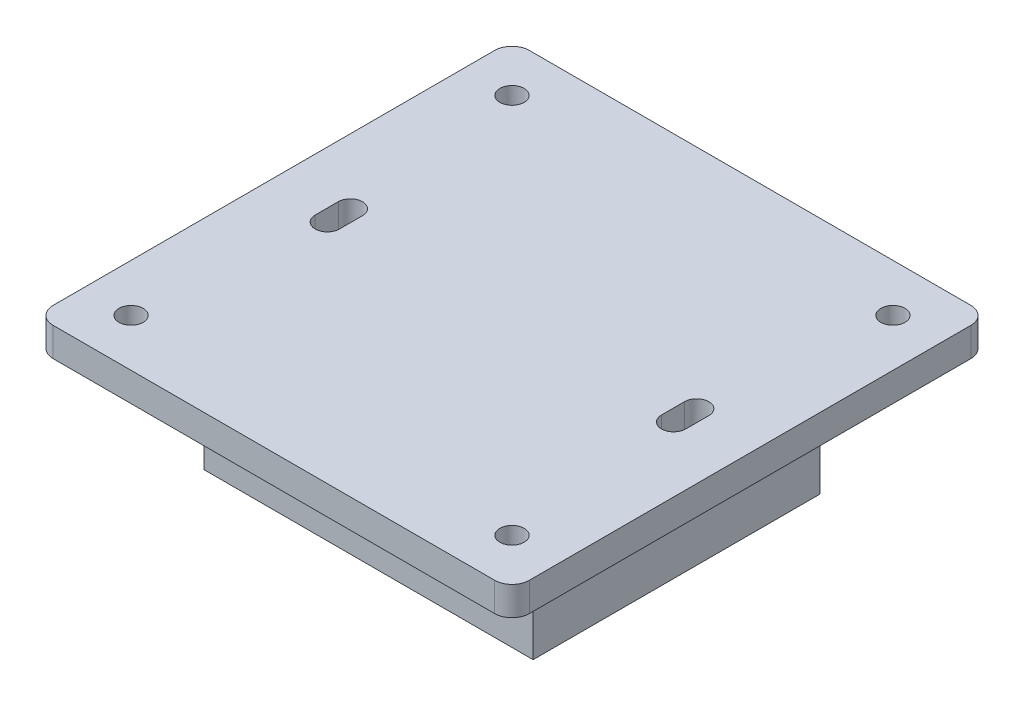
ISO-10303-21;
HEADER;
FILE_DESCRIPTION(('STEP AP214'),'2;1');
FILE_NAME('part.step','',(''),(''),'','','');
FILE_SCHEMA(('AUTOMOTIVE_DESIGN { 1 0 10303 214 1 1 1 1 }'));
ENDSEC;
DATA;
#1=APPLICATION_CONTEXT('core data for automotive mechanical design processes');
#2=APPLICATION_PROTOCOL_DEFINITION('international standard','automotive_design',2000,#1);
#3=PRODUCT_CONTEXT('',#1,'mechanical');
#4=PRODUCT('Part','Part','',(#3));
#5=PRODUCT_RELATED_PRODUCT_CATEGORY('part','',(#4));
#6=PRODUCT_DEFINITION_FORMATION('','',#4);
#7=PRODUCT_DEFINITION_CONTEXT('part definition',#1,'design');
#8=PRODUCT_DEFINITION('design','',#6,#7);
#9=PRODUCT_DEFINITION_SHAPE('','',#8);
#10=(LENGTH_UNIT() NAMED_UNIT(*) SI_UNIT(.MILLI.,.METRE.));
#11=(NAMED_UNIT(*) PLANE_ANGLE_UNIT() SI_UNIT($,.RADIAN.));
#12=(NAMED_UNIT(*) SI_UNIT($,.STERADIAN.) SOLID_ANGLE_UNIT());
#13=UNCERTAINTY_MEASURE_WITH_UNIT(LENGTH_MEASURE(1.E-05),#10,'distance_accuracy_value','');
#14=(GEOMETRIC_REPRESENTATION_CONTEXT(3) GLOBAL_UNCERTAINTY_ASSIGNED_CONTEXT((#13)) GLOBAL_UNIT_ASSIGNED_CONTEXT((#10,
#11,#12)) REPRESENTATION_CONTEXT('',''));
#15=CARTESIAN_POINT('',(0.,0.,0.));
#16=DIRECTION('',(0.,0.,1.));
#17=DIRECTION('',(1.,0.,0.));
#18=AXIS2_PLACEMENT_3D('',#15,#16,#17);
#19=CARTESIAN_POINT('',(-38.25,5.,38.25));
#20=DIRECTION('',(0.,-1.,0.));
#21=DIRECTION('',(0.,0.,-1.));
#22=AXIS2_PLACEMENT_3D('',#19,#20,#21);
#23=PLANE('',#22);
#24=CARTESIAN_POINT('',(-30.,5.,-2.));
#25=DIRECTION('',(0.,1.,0.));
#26=DIRECTION('',(0.,0.,-1.));
#27=AXIS2_PLACEMENT_3D('',#24,#25,#26);
#28=CIRCLE('',#27,2.1);
#29=CARTESIAN_POINT('',(-27.9,5.,-2.));
#30=VERTEX_POINT('',#29);
#31=CARTESIAN_POINT('',(-32.1,5.,-2.));
#32=VERTEX_POINT('',#31);
#33=EDGE_CURVE('E250',#30,#32,#28,.T.);
#34=ORIENTED_EDGE('',*,*,#33,.F.);
#35=DIRECTION('',(0.,0.,-1.));
#36=VECTOR('',#35,1.);
#37=CARTESIAN_POINT('',(-27.9,5.,2.));
#38=LINE('',#37,#36);
#39=CARTESIAN_POINT('',(-27.9,5.,2.));
#40=VERTEX_POINT('',#39);
#41=EDGE_CURVE('E258',#40,#30,#38,.T.);
#42=ORIENTED_EDGE('',*,*,#41,.F.);
#43=CARTESIAN_POINT('',(-30.,5.,2.));
#44=DIRECTION('',(0.,1.,0.));
#45=DIRECTION('',(0.,0.,1.));
#46=AXIS2_PLACEMENT_3D('',#43,#44,#45);
#47=CIRCLE('',#46,2.1);
#48=CARTESIAN_POINT('',(-32.1,5.,2.));
#49=VERTEX_POINT('',#48);
#50=EDGE_CURVE('E255',#49,#40,#47,.T.);
#51=ORIENTED_EDGE('',*,*,#50,.F.);
#52=DIRECTION('',(0.,0.,1.));
#53=VECTOR('',#52,1.);
#54=CARTESIAN_POINT('',(-32.1,5.,-2.));
#55=LINE('',#54,#53);
#56=EDGE_CURVE('E252',#32,#49,#55,.T.);
#57=ORIENTED_EDGE('',*,*,#56,.F.);
#58=EDGE_LOOP('',(#34,#42,#51,#57));
#59=FACE_BOUND('',#58,.T.);
#60=CARTESIAN_POINT('',(-38.25,5.,38.25));
#61=DIRECTION('',(0.,1.,0.));
#62=DIRECTION('',(0.,0.,-1.));
#63=AXIS2_PLACEMENT_3D('',#60,#61,#62);
#64=CIRCLE('',#63,3.);
#65=CARTESIAN_POINT('',(-41.25,5.,38.25));
#66=VERTEX_POINT('',#65);
#67=CARTESIAN_POINT('',(-38.25,5.,41.25));
#68=VERTEX_POINT('',#67);
#69=EDGE_CURVE('E307',#66,#68,#64,.T.);
#70=ORIENTED_EDGE('',*,*,#69,.T.);
#71=DIRECTION('',(1.,0.,0.));
#72=VECTOR('',#71,1.);
#73=CARTESIAN_POINT('',(-38.25,5.,41.25));
#74=LINE('',#73,#72);
#75=CARTESIAN_POINT('',(38.25,5.,41.25));
#76=VERTEX_POINT('',#75);
#77=EDGE_CURVE('E310',#68,#76,#74,.T.);
#78=ORIENTED_EDGE('',*,*,#77,.T.);
#79=CARTESIAN_POINT('',(38.25,5.,38.25));
#80=DIRECTION('',(0.,1.,0.));
#81=DIRECTION('',(0.,0.,1.));
#82=AXIS2_PLACEMENT_3D('',#79,#80,#81);
#83=CIRCLE('',#82,3.);
#84=CARTESIAN_POINT('',(41.25,5.,38.25));
#85=VERTEX_POINT('',#84);
#86=EDGE_CURVE('E313',#76,#85,#83,.T.);
#87=ORIENTED_EDGE('',*,*,#86,.T.);
#88=DIRECTION('',(0.,0.,-1.));
#89=VECTOR('',#88,1.);
#90=CARTESIAN_POINT('',(41.25,5.,38.25));
#91=LINE('',#90,#89);
#92=CARTESIAN_POINT('',(41.25,5.,-38.25));
#93=VERTEX_POINT('',#92);
#94=EDGE_CURVE('E315',#85,#93,#91,.T.);
#95=ORIENTED_EDGE('',*,*,#94,.T.);
#96=CARTESIAN_POINT('',(38.25,5.,-38.25));
#97=DIRECTION('',(0.,1.,0.));
#98=DIRECTION('',(0.,0.,-1.));
#99=AXIS2_PLACEMENT_3D('',#96,#97,#98);
#100=CIRCLE('',#99,3.);
#101=CARTESIAN_POINT('',(38.25,5.,-41.25));
#102=VERTEX_POINT('',#101);
#103=EDGE_CURVE('E317',#93,#102,#100,.T.);
#104=ORIENTED_EDGE('',*,*,#103,.T.);
#105=DIRECTION('',(-1.,0.,0.));
#106=VECTOR('',#105,1.);
#107=CARTESIAN_POINT('',(-38.25,5.,-41.25));
#108=LINE('',#107,#106);
#109=CARTESIAN_POINT('',(-38.25,5.,-41.25));
#110=VERTEX_POINT('',#109);
#111=EDGE_CURVE('E319',#102,#110,#108,.T.);
#112=ORIENTED_EDGE('',*,*,#111,.T.);
#113=CARTESIAN_POINT('',(-38.25,5.,-38.25));
#114=DIRECTION('',(0.,1.,0.));
#115=DIRECTION('',(0.,0.,-1.));
#116=AXIS2_PLACEMENT_3D('',#113,#114,#115);
#117=CIRCLE('',#116,3.);
#118=CARTESIAN_POINT('',(-41.25,5.,-38.25));
#119=VERTEX_POINT('',#118);
#120=EDGE_CURVE('E321',#110,#119,#117,.T.);
#121=ORIENTED_EDGE('',*,*,#120,.T.);
#122=DIRECTION('',(0.,0.,1.));
#123=VECTOR('',#122,1.);
#124=CARTESIAN_POINT('',(-41.25,5.,38.25));
#125=LINE('',#124,#123);
#126=EDGE_CURVE('E323',#119,#66,#125,.T.);
#127=ORIENTED_EDGE('',*,*,#126,.T.);
#128=EDGE_LOOP('',(#70,#78,#87,#95,#104,#112,#121,#127));
#129=FACE_BOUND('',#128,.T.);
#130=CARTESIAN_POINT('',(-33.,5.,-33.));
#131=DIRECTION('',(0.,1.,0.));
#132=DIRECTION('',(0.,0.,1.));
#133=AXIS2_PLACEMENT_3D('',#130,#131,#132);
#134=CIRCLE('',#133,2.10000000000303);
#135=CARTESIAN_POINT('',(-33.,5.,-30.899999999997));
#136=VERTEX_POINT('',#135);
#137=EDGE_CURVE('E301',#136,#136,#134,.T.);
#138=ORIENTED_EDGE('',*,*,#137,.F.);
#139=EDGE_LOOP('',(#138));
#140=FACE_BOUND('',#139,.T.);
#141=CARTESIAN_POINT('',(33.,5.,-33.0000000000021));
#142=DIRECTION('',(0.,1.,0.));
#143=DIRECTION('',(0.,0.,1.));
#144=AXIS2_PLACEMENT_3D('',#141,#142,#143);
#145=CIRCLE('',#144,2.10000000000303);
#146=CARTESIAN_POINT('',(33.,5.,-30.8999999999991));
#147=VERTEX_POINT('',#146);
#148=EDGE_CURVE('E295',#147,#147,#145,.T.);
#149=ORIENTED_EDGE('',*,*,#148,.F.);
#150=EDGE_LOOP('',(#149));
#151=FACE_BOUND('',#150,.T.);
#152=CARTESIAN_POINT('',(33.0000000000022,5.,32.9999999999979));
#153=DIRECTION('',(0.,1.,0.));
#154=DIRECTION('',(0.,0.,1.));
#155=AXIS2_PLACEMENT_3D('',#152,#153,#154);
#156=CIRCLE('',#155,2.10000000000303);
#157=CARTESIAN_POINT('',(33.0000000000022,5.,35.1000000000009));
#158=VERTEX_POINT('',#157);
#159=EDGE_CURVE('E289',#158,#158,#156,.T.);
#160=ORIENTED_EDGE('',*,*,#159,.F.);
#161=EDGE_LOOP('',(#160));
#162=FACE_BOUND('',#161,.T.);
#163=CARTESIAN_POINT('',(-32.9999999999978,5.,33.));
#164=DIRECTION('',(0.,1.,0.));
#165=DIRECTION('',(0.,0.,1.));
#166=AXIS2_PLACEMENT_3D('',#163,#164,#165);
#167=CIRCLE('',#166,2.10000000000303);
#168=CARTESIAN_POINT('',(-32.9999999999978,5.,35.100000000003));
#169=VERTEX_POINT('',#168);
#170=EDGE_CURVE('E283',#169,#169,#167,.T.);
#171=ORIENTED_EDGE('',*,*,#170,.F.);
#172=EDGE_LOOP('',(#171));
#173=FACE_BOUND('',#172,.T.);
#174=CARTESIAN_POINT('',(30.,5.,2.));
#175=DIRECTION('',(0.,1.,0.));
#176=DIRECTION('',(0.,0.,-1.));
#177=AXIS2_PLACEMENT_3D('',#174,#175,#176);
#178=CIRCLE('',#177,2.1);
#179=CARTESIAN_POINT('',(27.9,5.,2.));
#180=VERTEX_POINT('',#179);
#181=CARTESIAN_POINT('',(32.1,5.,2.));
#182=VERTEX_POINT('',#181);
#183=EDGE_CURVE('E220',#180,#182,#178,.T.);
#184=ORIENTED_EDGE('',*,*,#183,.F.);
#185=DIRECTION('',(0.,0.,1.));
#186=VECTOR('',#185,1.);
#187=CARTESIAN_POINT('',(27.9,5.,2.));
#188=LINE('',#187,#186);
#189=CARTESIAN_POINT('',(27.9,5.,-2.));
#190=VERTEX_POINT('',#189);
#191=EDGE_CURVE('E228',#190,#180,#188,.T.);
#192=ORIENTED_EDGE('',*,*,#191,.F.);
#193=CARTESIAN_POINT('',(30.,5.,-2.));
#194=DIRECTION('',(0.,1.,0.));
#195=DIRECTION('',(0.,0.,1.));
#196=AXIS2_PLACEMENT_3D('',#193,#194,#195);
#197=CIRCLE('',#196,2.1);
#198=CARTESIAN_POINT('',(32.1,5.,-2.));
#199=VERTEX_POINT('',#198);
#200=EDGE_CURVE('E225',#199,#190,#197,.T.);
#201=ORIENTED_EDGE('',*,*,#200,.F.);
#202=DIRECTION('',(0.,0.,-1.));
#203=VECTOR('',#202,1.);
#204=CARTESIAN_POINT('',(32.1,5.,2.));
#205=LINE('',#204,#203);
#206=EDGE_CURVE('E222',#182,#199,#205,.T.);
#207=ORIENTED_EDGE('',*,*,#206,.F.);
#208=EDGE_LOOP('',(#184,#192,#201,#207));
#209=FACE_BOUND('',#208,.T.);
#210=ADVANCED_FACE('F37',(#59,#129,#140,#151,#162,#173,#209),#23,.F.);
#211=CARTESIAN_POINT('',(-38.25,0.,38.25));
#212=DIRECTION('',(0.,-1.,0.));
#213=DIRECTION('',(0.,0.,-1.));
#214=AXIS2_PLACEMENT_3D('',#211,#212,#213);
#215=PLANE('',#214);
#216=DIRECTION('',(0.,0.,1.));
#217=VECTOR('',#216,1.);
#218=CARTESIAN_POINT('',(28.5,0.,24.8387239964973));
#219=LINE('',#218,#217);
#220=CARTESIAN_POINT('',(28.5,0.,-24.8387239964973));
#221=VERTEX_POINT('',#220);
#222=CARTESIAN_POINT('',(28.5,0.,-3.4696938456699));
#223=VERTEX_POINT('',#222);
#224=EDGE_CURVE('E56',#221,#223,#219,.T.);
#225=ORIENTED_EDGE('',*,*,#224,.F.);
#226=DIRECTION('',(1.,0.,0.));
#227=VECTOR('',#226,1.);
#228=CARTESIAN_POINT('',(-28.5,0.,-24.8387239964973));
#229=LINE('',#228,#227);
#230=CARTESIAN_POINT('',(-28.5,0.,-24.8387239964973));
#231=VERTEX_POINT('',#230);
#232=EDGE_CURVE('E60',#231,#221,#229,.T.);
#233=ORIENTED_EDGE('',*,*,#232,.F.);
#234=DIRECTION('',(0.,0.,-1.));
#235=VECTOR('',#234,1.);
#236=CARTESIAN_POINT('',(-28.5,0.,24.8387239964973));
#237=LINE('',#236,#235);
#238=CARTESIAN_POINT('',(-28.5,0.,-3.46969384566992));
#239=VERTEX_POINT('',#238);
#240=EDGE_CURVE('E11',#239,#231,#237,.T.);
#241=ORIENTED_EDGE('',*,*,#240,.F.);
#242=CARTESIAN_POINT('',(-30.,0.,-2.));
#243=DIRECTION('',(0.,1.,0.));
#244=DIRECTION('',(0.,0.,-1.));
#245=AXIS2_PLACEMENT_3D('',#242,#243,#244);
#246=CIRCLE('',#245,2.1);
#247=CARTESIAN_POINT('',(-32.1,0.,-2.));
#248=VERTEX_POINT('',#247);
#249=EDGE_CURVE('E249',#239,#248,#246,.T.);
#250=ORIENTED_EDGE('',*,*,#249,.T.);
#251=DIRECTION('',(0.,0.,1.));
#252=VECTOR('',#251,1.);
#253=CARTESIAN_POINT('',(-32.1,0.,-2.));
#254=LINE('',#253,#252);
#255=CARTESIAN_POINT('',(-32.1,0.,2.));
#256=VERTEX_POINT('',#255);
#257=EDGE_CURVE('E264',#248,#256,#254,.T.);
#258=ORIENTED_EDGE('',*,*,#257,.T.);
#259=CARTESIAN_POINT('',(-30.,0.,2.));
#260=DIRECTION('',(0.,1.,0.));
#261=DIRECTION('',(0.,0.,1.));
#262=AXIS2_PLACEMENT_3D('',#259,#260,#261);
#263=CIRCLE('',#262,2.1);
#264=CARTESIAN_POINT('',(-28.5,0.,3.46969384566992));
#265=VERTEX_POINT('',#264);
#266=EDGE_CURVE('E268',#256,#265,#263,.T.);
#267=ORIENTED_EDGE('',*,*,#266,.T.);
#268=CARTESIAN_POINT('',(-28.5,0.,24.8387239964973));
#269=VERTEX_POINT('',#268);
#270=EDGE_CURVE('E48',#269,#265,#237,.T.);
#271=ORIENTED_EDGE('',*,*,#270,.F.);
#272=DIRECTION('',(-1.,0.,0.));
#273=VECTOR('',#272,1.);
#274=CARTESIAN_POINT('',(-28.5,0.,24.8387239964973));
#275=LINE('',#274,#273);
#276=CARTESIAN_POINT('',(28.5,0.,24.8387239964973));
#277=VERTEX_POINT('',#276);
#278=EDGE_CURVE('E370',#277,#269,#275,.T.);
#279=ORIENTED_EDGE('',*,*,#278,.F.);
#280=CARTESIAN_POINT('',(28.5,0.,3.4696938456699));
#281=VERTEX_POINT('',#280);
#282=EDGE_CURVE('E46',#281,#277,#219,.T.);
#283=ORIENTED_EDGE('',*,*,#282,.F.);
#284=CARTESIAN_POINT('',(30.,0.,2.));
#285=DIRECTION('',(0.,1.,0.));
#286=DIRECTION('',(0.,0.,-1.));
#287=AXIS2_PLACEMENT_3D('',#284,#285,#286);
#288=CIRCLE('',#287,2.1);
#289=CARTESIAN_POINT('',(32.1,0.,2.));
#290=VERTEX_POINT('',#289);
#291=EDGE_CURVE('E212',#281,#290,#288,.T.);
#292=ORIENTED_EDGE('',*,*,#291,.T.);
#293=DIRECTION('',(0.,0.,-1.));
#294=VECTOR('',#293,1.);
#295=CARTESIAN_POINT('',(32.1,0.,2.));
#296=LINE('',#295,#294);
#297=CARTESIAN_POINT('',(32.1,0.,-2.));
#298=VERTEX_POINT('',#297);
#299=EDGE_CURVE('E232',#290,#298,#296,.T.);
#300=ORIENTED_EDGE('',*,*,#299,.T.);
#301=CARTESIAN_POINT('',(30.,0.,-2.));
#302=DIRECTION('',(0.,1.,0.));
#303=DIRECTION('',(0.,0.,1.));
#304=AXIS2_PLACEMENT_3D('',#301,#302,#303);
#305=CIRCLE('',#304,2.1);
#306=EDGE_CURVE('E236',#298,#223,#305,.T.);
#307=ORIENTED_EDGE('',*,*,#306,.T.);
#308=EDGE_LOOP('',(#225,#233,#241,#250,#258,#267,#271,#279,#283,#292,#300,#307));
#309=FACE_BOUND('',#308,.T.);
#310=CARTESIAN_POINT('',(33.0000000000022,0.,32.9999999999979));
#311=DIRECTION('',(0.,1.,0.));
#312=DIRECTION('',(0.,0.,1.));
#313=AXIS2_PLACEMENT_3D('',#310,#311,#312);
#314=CIRCLE('',#313,2.10000000000303);
#315=CARTESIAN_POINT('',(33.0000000000022,0.,35.1000000000009));
#316=VERTEX_POINT('',#315);
#317=EDGE_CURVE('E286',#316,#316,#314,.T.);
#318=ORIENTED_EDGE('',*,*,#317,.T.);
#319=EDGE_LOOP('',(#318));
#320=FACE_BOUND('',#319,.T.);
#321=CARTESIAN_POINT('',(-33.,0.,-33.));
#322=DIRECTION('',(0.,1.,0.));
#323=DIRECTION('',(0.,0.,1.));
#324=AXIS2_PLACEMENT_3D('',#321,#322,#323);
#325=CIRCLE('',#324,2.10000000000303);
#326=CARTESIAN_POINT('',(-33.,0.,-30.899999999997));
#327=VERTEX_POINT('',#326);
#328=EDGE_CURVE('E298',#327,#327,#325,.T.);
#329=ORIENTED_EDGE('',*,*,#328,.T.);
#330=EDGE_LOOP('',(#329));
#331=FACE_BOUND('',#330,.T.);
#332=CARTESIAN_POINT('',(-38.25,0.,38.25));
#333=DIRECTION('',(0.,1.,0.));
#334=DIRECTION('',(0.,0.,-1.));
#335=AXIS2_PLACEMENT_3D('',#332,#333,#334);
#336=CIRCLE('',#335,3.);
#337=CARTESIAN_POINT('',(-41.25,0.,38.25));
#338=VERTEX_POINT('',#337);
#339=CARTESIAN_POINT('',(-38.25,0.,41.25));
#340=VERTEX_POINT('',#339);
#341=EDGE_CURVE('E304',#338,#340,#336,.T.);
#342=ORIENTED_EDGE('',*,*,#341,.F.);
#343=DIRECTION('',(0.,0.,1.));
#344=VECTOR('',#343,1.);
#345=CARTESIAN_POINT('',(-41.25,0.,38.25));
#346=LINE('',#345,#344);
#347=CARTESIAN_POINT('',(-41.25,0.,-38.25));
#348=VERTEX_POINT('',#347);
#349=EDGE_CURVE('E311',#348,#338,#346,.T.);
#350=ORIENTED_EDGE('',*,*,#349,.F.);
#351=CARTESIAN_POINT('',(-38.25,0.,-38.25));
#352=DIRECTION('',(0.,1.,0.));
#353=DIRECTION('',(0.,0.,-1.));
#354=AXIS2_PLACEMENT_3D('',#351,#352,#353);
#355=CIRCLE('',#354,3.);
#356=CARTESIAN_POINT('',(-38.25,0.,-41.25));
#357=VERTEX_POINT('',#356);
#358=EDGE_CURVE('E338',#357,#348,#355,.T.);
#359=ORIENTED_EDGE('',*,*,#358,.F.);
#360=DIRECTION('',(-1.,0.,0.));
#361=VECTOR('',#360,1.);
#362=CARTESIAN_POINT('',(-38.25,0.,-41.25));
#363=LINE('',#362,#361);
#364=CARTESIAN_POINT('',(38.25,0.,-41.25));
#365=VERTEX_POINT('',#364);
#366=EDGE_CURVE('E336',#365,#357,#363,.T.);
#367=ORIENTED_EDGE('',*,*,#366,.F.);
#368=CARTESIAN_POINT('',(38.25,0.,-38.25));
#369=DIRECTION('',(0.,1.,0.));
#370=DIRECTION('',(0.,0.,-1.));
#371=AXIS2_PLACEMENT_3D('',#368,#369,#370);
#372=CIRCLE('',#371,3.);
#373=CARTESIAN_POINT('',(41.25,0.,-38.25));
#374=VERTEX_POINT('',#373);
#375=EDGE_CURVE('E334',#374,#365,#372,.T.);
#376=ORIENTED_EDGE('',*,*,#375,.F.);
#377=DIRECTION('',(0.,0.,-1.));
#378=VECTOR('',#377,1.);
#379=CARTESIAN_POINT('',(41.25,0.,38.25));
#380=LINE('',#379,#378);
#381=CARTESIAN_POINT('',(41.25,0.,38.25));
#382=VERTEX_POINT('',#381);
#383=EDGE_CURVE('E332',#382,#374,#380,.T.);
#384=ORIENTED_EDGE('',*,*,#383,.F.);
#385=CARTESIAN_POINT('',(38.25,0.,38.25));
#386=DIRECTION('',(0.,1.,0.));
#387=DIRECTION('',(0.,0.,1.));
#388=AXIS2_PLACEMENT_3D('',#385,#386,#387);
#389=CIRCLE('',#388,3.);
#390=CARTESIAN_POINT('',(38.25,0.,41.25));
#391=VERTEX_POINT('',#390);
#392=EDGE_CURVE('E330',#391,#382,#389,.T.);
#393=ORIENTED_EDGE('',*,*,#392,.F.);
#394=DIRECTION('',(1.,0.,0.));
#395=VECTOR('',#394,1.);
#396=CARTESIAN_POINT('',(-38.25,0.,41.25));
#397=LINE('',#396,#395);
#398=EDGE_CURVE('E328',#340,#391,#397,.T.);
#399=ORIENTED_EDGE('',*,*,#398,.F.);
#400=EDGE_LOOP('',(#342,#350,#359,#367,#376,#384,#393,#399));
#401=FACE_BOUND('',#400,.T.);
#402=CARTESIAN_POINT('',(33.,0.,-33.0000000000021));
#403=DIRECTION('',(0.,1.,0.));
#404=DIRECTION('',(0.,0.,1.));
#405=AXIS2_PLACEMENT_3D('',#402,#403,#404);
#406=CIRCLE('',#405,2.10000000000303);
#407=CARTESIAN_POINT('',(33.,0.,-30.8999999999991));
#408=VERTEX_POINT('',#407);
#409=EDGE_CURVE('E292',#408,#408,#406,.T.);
#410=ORIENTED_EDGE('',*,*,#409,.T.);
#411=EDGE_LOOP('',(#410));
#412=FACE_BOUND('',#411,.T.);
#413=CARTESIAN_POINT('',(-32.9999999999978,0.,33.));
#414=DIRECTION('',(0.,1.,0.));
#415=DIRECTION('',(0.,0.,1.));
#416=AXIS2_PLACEMENT_3D('',#413,#414,#415);
#417=CIRCLE('',#416,2.10000000000303);
#418=CARTESIAN_POINT('',(-32.9999999999978,0.,35.100000000003));
#419=VERTEX_POINT('',#418);
#420=EDGE_CURVE('E282',#419,#419,#417,.T.);
#421=ORIENTED_EDGE('',*,*,#420,.T.);
#422=EDGE_LOOP('',(#421));
#423=FACE_BOUND('',#422,.T.);
#424=ADVANCED_FACE('F393',(#309,#320,#331,#401,#412,#423),#215,.T.);
#425=CARTESIAN_POINT('',(-38.25,5.,38.25));
#426=DIRECTION('',(0.,-1.,0.));
#427=DIRECTION('',(0.,0.,-1.));
#428=AXIS2_PLACEMENT_3D('',#425,#426,#427);
#429=CYLINDRICAL_SURFACE('',#428,3.);
#430=ORIENTED_EDGE('',*,*,#341,.T.);
#431=DIRECTION('',(0.,-1.,0.));
#432=VECTOR('',#431,1.);
#433=CARTESIAN_POINT('',(-38.25,5.,41.25));
#434=LINE('',#433,#432);
#435=EDGE_CURVE('E41',#68,#340,#434,.T.);
#436=ORIENTED_EDGE('',*,*,#435,.F.);
#437=ORIENTED_EDGE('',*,*,#69,.F.);
#438=DIRECTION('',(0.,-1.,0.));
#439=VECTOR('',#438,1.);
#440=CARTESIAN_POINT('',(-41.25,5.,38.25));
#441=LINE('',#440,#439);
#442=EDGE_CURVE('E325',#66,#338,#441,.T.);
#443=ORIENTED_EDGE('',*,*,#442,.T.);
#444=EDGE_LOOP('',(#430,#436,#437,#443));
#445=FACE_BOUND('',#444,.T.);
#446=ADVANCED_FACE('F39',(#445),#429,.T.);
#447=CARTESIAN_POINT('',(-38.25,5.,41.25));
#448=DIRECTION('',(0.,0.,-1.));
#449=DIRECTION('',(-1.,0.,0.));
#450=AXIS2_PLACEMENT_3D('',#447,#448,#449);
#451=PLANE('',#450);
#452=ORIENTED_EDGE('',*,*,#398,.T.);
#453=DIRECTION('',(0.,-1.,0.));
#454=VECTOR('',#453,1.);
#455=CARTESIAN_POINT('',(38.25,5.,41.25));
#456=LINE('',#455,#454);
#457=EDGE_CURVE('E357',#76,#391,#456,.T.);
#458=ORIENTED_EDGE('',*,*,#457,.F.);
#459=ORIENTED_EDGE('',*,*,#77,.F.);
#460=ORIENTED_EDGE('',*,*,#435,.T.);
#461=EDGE_LOOP('',(#452,#458,#459,#460));
#462=FACE_BOUND('',#461,.T.);
#463=ADVANCED_FACE('F471',(#462),#451,.F.);
#464=CARTESIAN_POINT('',(38.25,5.,38.25));
#465=DIRECTION('',(0.,-1.,0.));
#466=DIRECTION('',(0.,0.,-1.));
#467=AXIS2_PLACEMENT_3D('',#464,#465,#466);
#468=CYLINDRICAL_SURFACE('',#467,3.);
#469=ORIENTED_EDGE('',*,*,#392,.T.);
#470=DIRECTION('',(0.,-1.,0.));
#471=VECTOR('',#470,1.);
#472=CARTESIAN_POINT('',(41.25,5.,38.25));
#473=LINE('',#472,#471);
#474=EDGE_CURVE('E355',#85,#382,#473,.T.);
#475=ORIENTED_EDGE('',*,*,#474,.F.);
#476=ORIENTED_EDGE('',*,*,#86,.F.);
#477=ORIENTED_EDGE('',*,*,#457,.T.);
#478=EDGE_LOOP('',(#469,#475,#476,#477));
#479=FACE_BOUND('',#478,.T.);
#480=ADVANCED_FACE('F468',(#479),#468,.T.);
#481=CARTESIAN_POINT('',(41.25,5.,38.25));
#482=DIRECTION('',(-1.,0.,0.));
#483=DIRECTION('',(0.,0.,1.));
#484=AXIS2_PLACEMENT_3D('',#481,#482,#483);
#485=PLANE('',#484);
#486=ORIENTED_EDGE('',*,*,#383,.T.);
#487=DIRECTION('',(0.,-1.,0.));
#488=VECTOR('',#487,1.);
#489=CARTESIAN_POINT('',(41.25,5.,-38.25));
#490=LINE('',#489,#488);
#491=EDGE_CURVE('E352',#93,#374,#490,.T.);
#492=ORIENTED_EDGE('',*,*,#491,.F.);
#493=ORIENTED_EDGE('',*,*,#94,.F.);
#494=ORIENTED_EDGE('',*,*,#474,.T.);
#495=EDGE_LOOP('',(#486,#492,#493,#494));
#496=FACE_BOUND('',#495,.T.);
#497=ADVANCED_FACE('F464',(#496),#485,.F.);
#498=CARTESIAN_POINT('',(38.25,5.,-38.25));
#499=DIRECTION('',(0.,-1.,0.));
#500=DIRECTION('',(0.,0.,-1.));
#501=AXIS2_PLACEMENT_3D('',#498,#499,#500);
#502=CYLINDRICAL_SURFACE('',#501,3.);
#503=ORIENTED_EDGE('',*,*,#375,.T.);
#504=DIRECTION('',(0.,-1.,0.));
#505=VECTOR('',#504,1.);
#506=CARTESIAN_POINT('',(38.25,5.,-41.25));
#507=LINE('',#506,#505);
#508=EDGE_CURVE('E349',#102,#365,#507,.T.);
#509=ORIENTED_EDGE('',*,*,#508,.F.);
#510=ORIENTED_EDGE('',*,*,#103,.F.);
#511=ORIENTED_EDGE('',*,*,#491,.T.);
#512=EDGE_LOOP('',(#503,#509,#510,#511));
#513=FACE_BOUND('',#512,.T.);
#514=ADVANCED_FACE('F460',(#513),#502,.T.);
#515=CARTESIAN_POINT('',(-38.25,5.,-41.25));
#516=DIRECTION('',(0.,0.,1.));
#517=DIRECTION('',(1.,0.,0.));
#518=AXIS2_PLACEMENT_3D('',#515,#516,#517);
#519=PLANE('',#518);
#520=ORIENTED_EDGE('',*,*,#366,.T.);
#521=DIRECTION('',(0.,-1.,0.));
#522=VECTOR('',#521,1.);
#523=CARTESIAN_POINT('',(-38.25,5.,-41.25));
#524=LINE('',#523,#522);
#525=EDGE_CURVE('E346',#110,#357,#524,.T.);
#526=ORIENTED_EDGE('',*,*,#525,.F.);
#527=ORIENTED_EDGE('',*,*,#111,.F.);
#528=ORIENTED_EDGE('',*,*,#508,.T.);
#529=EDGE_LOOP('',(#520,#526,#527,#528));
#530=FACE_BOUND('',#529,.T.);
#531=ADVANCED_FACE('F456',(#530),#519,.F.);
#532=CARTESIAN_POINT('',(-38.25,5.,-38.25));
#533=DIRECTION('',(0.,-1.,0.));
#534=DIRECTION('',(0.,0.,-1.));
#535=AXIS2_PLACEMENT_3D('',#532,#533,#534);
#536=CYLINDRICAL_SURFACE('',#535,3.);
#537=ORIENTED_EDGE('',*,*,#358,.T.);
#538=DIRECTION('',(0.,-1.,0.));
#539=VECTOR('',#538,1.);
#540=CARTESIAN_POINT('',(-41.25,5.,-38.25));
#541=LINE('',#540,#539);
#542=EDGE_CURVE('E343',#119,#348,#541,.T.);
#543=ORIENTED_EDGE('',*,*,#542,.F.);
#544=ORIENTED_EDGE('',*,*,#120,.F.);
#545=ORIENTED_EDGE('',*,*,#525,.T.);
#546=EDGE_LOOP('',(#537,#543,#544,#545));
#547=FACE_BOUND('',#546,.T.);
#548=ADVANCED_FACE('F452',(#547),#536,.T.);
#549=CARTESIAN_POINT('',(-41.25,5.,38.25));
#550=DIRECTION('',(1.,0.,0.));
#551=DIRECTION('',(0.,0.,-1.));
#552=AXIS2_PLACEMENT_3D('',#549,#550,#551);
#553=PLANE('',#552);
#554=ORIENTED_EDGE('',*,*,#349,.T.);
#555=ORIENTED_EDGE('',*,*,#442,.F.);
#556=ORIENTED_EDGE('',*,*,#126,.F.);
#557=ORIENTED_EDGE('',*,*,#542,.T.);
#558=EDGE_LOOP('',(#554,#555,#556,#557));
#559=FACE_BOUND('',#558,.T.);
#560=ADVANCED_FACE('F449',(#559),#553,.F.);
#561=CARTESIAN_POINT('',(-33.,5.,-33.));
#562=DIRECTION('',(0.,-1.,0.));
#563=DIRECTION('',(0.,0.,-1.));
#564=AXIS2_PLACEMENT_3D('',#561,#562,#563);
#565=CYLINDRICAL_SURFACE('',#564,2.10000000000303);
#566=ORIENTED_EDGE('',*,*,#137,.T.);
#567=EDGE_LOOP('',(#566));
#568=FACE_BOUND('',#567,.T.);
#569=ORIENTED_EDGE('',*,*,#328,.F.);
#570=EDGE_LOOP('',(#569));
#571=FACE_BOUND('',#570,.T.);
#572=ADVANCED_FACE('F446',(#568,#571),#565,.F.);
#573=CARTESIAN_POINT('',(33.,5.,-33.0000000000021));
#574=DIRECTION('',(0.,-1.,0.));
#575=DIRECTION('',(0.,0.,-1.));
#576=AXIS2_PLACEMENT_3D('',#573,#574,#575);
#577=CYLINDRICAL_SURFACE('',#576,2.10000000000303);
#578=ORIENTED_EDGE('',*,*,#148,.T.);
#579=EDGE_LOOP('',(#578));
#580=FACE_BOUND('',#579,.T.);
#581=ORIENTED_EDGE('',*,*,#409,.F.);
#582=EDGE_LOOP('',(#581));
#583=FACE_BOUND('',#582,.T.);
#584=ADVANCED_FACE('F518',(#580,#583),#577,.F.);
#585=CARTESIAN_POINT('',(33.0000000000022,5.,32.9999999999979));
#586=DIRECTION('',(0.,-1.,0.));
#587=DIRECTION('',(0.,0.,-1.));
#588=AXIS2_PLACEMENT_3D('',#585,#586,#587);
#589=CYLINDRICAL_SURFACE('',#588,2.10000000000303);
#590=ORIENTED_EDGE('',*,*,#159,.T.);
#591=EDGE_LOOP('',(#590));
#592=FACE_BOUND('',#591,.T.);
#593=ORIENTED_EDGE('',*,*,#317,.F.);
#594=EDGE_LOOP('',(#593));
#595=FACE_BOUND('',#594,.T.);
#596=ADVANCED_FACE('F509',(#592,#595),#589,.F.);
#597=CARTESIAN_POINT('',(-32.9999999999978,5.,33.));
#598=DIRECTION('',(0.,-1.,0.));
#599=DIRECTION('',(0.,0.,-1.));
#600=AXIS2_PLACEMENT_3D('',#597,#598,#599);
#601=CYLINDRICAL_SURFACE('',#600,2.10000000000303);
#602=ORIENTED_EDGE('',*,*,#170,.T.);
#603=EDGE_LOOP('',(#602));
#604=FACE_BOUND('',#603,.T.);
#605=ORIENTED_EDGE('',*,*,#420,.F.);
#606=EDGE_LOOP('',(#605));
#607=FACE_BOUND('',#606,.T.);
#608=ADVANCED_FACE('F506',(#604,#607),#601,.F.);
#609=CARTESIAN_POINT('',(-30.,5.,-2.));
#610=DIRECTION('',(0.,-1.,0.));
#611=DIRECTION('',(0.,0.,-1.));
#612=AXIS2_PLACEMENT_3D('',#609,#610,#611);
#613=CYLINDRICAL_SURFACE('',#612,2.1);
#614=CARTESIAN_POINT('',(-27.9,0.,-2.));
#615=VERTEX_POINT('',#614);
#616=EDGE_CURVE('E261',#615,#239,#246,.T.);
#617=ORIENTED_EDGE('',*,*,#616,.F.);
#618=DIRECTION('',(0.,-1.,0.));
#619=VECTOR('',#618,1.);
#620=CARTESIAN_POINT('',(-27.9,5.,-2.));
#621=LINE('',#620,#619);
#622=EDGE_CURVE('E260',#30,#615,#621,.T.);
#623=ORIENTED_EDGE('',*,*,#622,.F.);
#624=ORIENTED_EDGE('',*,*,#33,.T.);
#625=DIRECTION('',(0.,-1.,0.));
#626=VECTOR('',#625,1.);
#627=CARTESIAN_POINT('',(-32.1,5.,-2.));
#628=LINE('',#627,#626);
#629=EDGE_CURVE('E279',#32,#248,#628,.T.);
#630=ORIENTED_EDGE('',*,*,#629,.T.);
#631=ORIENTED_EDGE('',*,*,#249,.F.);
#632=EDGE_LOOP('',(#617,#623,#624,#630,#631));
#633=FACE_BOUND('',#632,.T.);
#634=ADVANCED_FACE('F410',(#633),#613,.F.);
#635=CARTESIAN_POINT('',(-32.1,5.,-2.));
#636=DIRECTION('',(1.,0.,0.));
#637=DIRECTION('',(0.,0.,-1.));
#638=AXIS2_PLACEMENT_3D('',#635,#636,#637);
#639=PLANE('',#638);
#640=ORIENTED_EDGE('',*,*,#257,.F.);
#641=ORIENTED_EDGE('',*,*,#629,.F.);
#642=ORIENTED_EDGE('',*,*,#56,.T.);
#643=DIRECTION('',(0.,-1.,0.));
#644=VECTOR('',#643,1.);
#645=CARTESIAN_POINT('',(-32.1,5.,2.));
#646=LINE('',#645,#644);
#647=EDGE_CURVE('E277',#49,#256,#646,.T.);
#648=ORIENTED_EDGE('',*,*,#647,.T.);
#649=EDGE_LOOP('',(#640,#641,#642,#648));
#650=FACE_BOUND('',#649,.T.);
#651=ADVANCED_FACE('F427',(#650),#639,.T.);
#652=CARTESIAN_POINT('',(-30.,5.,2.));
#653=DIRECTION('',(0.,-1.,0.));
#654=DIRECTION('',(0.,0.,-1.));
#655=AXIS2_PLACEMENT_3D('',#652,#653,#654);
#656=CYLINDRICAL_SURFACE('',#655,2.1);
#657=ORIENTED_EDGE('',*,*,#266,.F.);
#658=ORIENTED_EDGE('',*,*,#647,.F.);
#659=ORIENTED_EDGE('',*,*,#50,.T.);
#660=DIRECTION('',(0.,-1.,0.));
#661=VECTOR('',#660,1.);
#662=CARTESIAN_POINT('',(-27.9,5.,2.));
#663=LINE('',#662,#661);
#664=CARTESIAN_POINT('',(-27.9,0.,2.));
#665=VERTEX_POINT('',#664);
#666=EDGE_CURVE('E275',#40,#665,#663,.T.);
#667=ORIENTED_EDGE('',*,*,#666,.T.);
#668=EDGE_CURVE('E267',#265,#665,#263,.T.);
#669=ORIENTED_EDGE('',*,*,#668,.F.);
#670=EDGE_LOOP('',(#657,#658,#659,#667,#669));
#671=FACE_BOUND('',#670,.T.);
#672=ADVANCED_FACE('F430',(#671),#656,.F.);
#673=CARTESIAN_POINT('',(-27.9,5.,2.));
#674=DIRECTION('',(-1.,0.,0.));
#675=DIRECTION('',(0.,0.,1.));
#676=AXIS2_PLACEMENT_3D('',#673,#674,#675);
#677=PLANE('',#676);
#678=DIRECTION('',(0.,0.,-1.));
#679=VECTOR('',#678,1.);
#680=CARTESIAN_POINT('',(-27.9,0.,2.));
#681=LINE('',#680,#679);
#682=EDGE_CURVE('E253',#665,#615,#681,.T.);
#683=ORIENTED_EDGE('',*,*,#682,.F.);
#684=ORIENTED_EDGE('',*,*,#666,.F.);
#685=ORIENTED_EDGE('',*,*,#41,.T.);
#686=ORIENTED_EDGE('',*,*,#622,.T.);
#687=EDGE_LOOP('',(#683,#684,#685,#686));
#688=FACE_BOUND('',#687,.T.);
#689=ADVANCED_FACE('F418',(#688),#677,.T.);
#690=CARTESIAN_POINT('',(30.,5.,2.));
#691=DIRECTION('',(0.,-1.,0.));
#692=DIRECTION('',(0.,0.,-1.));
#693=AXIS2_PLACEMENT_3D('',#690,#691,#692);
#694=CYLINDRICAL_SURFACE('',#693,2.1);
#695=CARTESIAN_POINT('',(27.9,0.,2.));
#696=VERTEX_POINT('',#695);
#697=EDGE_CURVE('E214',#696,#281,#288,.T.);
#698=ORIENTED_EDGE('',*,*,#697,.F.);
#699=DIRECTION('',(0.,-1.,0.));
#700=VECTOR('',#699,1.);
#701=CARTESIAN_POINT('',(27.9,5.,2.));
#702=LINE('',#701,#700);
#703=EDGE_CURVE('E229',#180,#696,#702,.T.);
#704=ORIENTED_EDGE('',*,*,#703,.F.);
#705=ORIENTED_EDGE('',*,*,#183,.T.);
#706=DIRECTION('',(0.,-1.,0.));
#707=VECTOR('',#706,1.);
#708=CARTESIAN_POINT('',(32.1,5.,2.));
#709=LINE('',#708,#707);
#710=EDGE_CURVE('E246',#182,#290,#709,.T.);
#711=ORIENTED_EDGE('',*,*,#710,.T.);
#712=ORIENTED_EDGE('',*,*,#291,.F.);
#713=EDGE_LOOP('',(#698,#704,#705,#711,#712));
#714=FACE_BOUND('',#713,.T.);
#715=ADVANCED_FACE('F379',(#714),#694,.F.);
#716=CARTESIAN_POINT('',(32.1,5.,2.));
#717=DIRECTION('',(-1.,0.,0.));
#718=DIRECTION('',(0.,0.,1.));
#719=AXIS2_PLACEMENT_3D('',#716,#717,#718);
#720=PLANE('',#719);
#721=ORIENTED_EDGE('',*,*,#299,.F.);
#722=ORIENTED_EDGE('',*,*,#710,.F.);
#723=ORIENTED_EDGE('',*,*,#206,.T.);
#724=DIRECTION('',(0.,-1.,0.));
#725=VECTOR('',#724,1.);
#726=CARTESIAN_POINT('',(32.1,5.,-2.));
#727=LINE('',#726,#725);
#728=EDGE_CURVE('E244',#199,#298,#727,.T.);
#729=ORIENTED_EDGE('',*,*,#728,.T.);
#730=EDGE_LOOP('',(#721,#722,#723,#729));
#731=FACE_BOUND('',#730,.T.);
#732=ADVANCED_FACE('F390',(#731),#720,.T.);
#733=CARTESIAN_POINT('',(30.,5.,-2.));
#734=DIRECTION('',(0.,-1.,0.));
#735=DIRECTION('',(0.,0.,-1.));
#736=AXIS2_PLACEMENT_3D('',#733,#734,#735);
#737=CYLINDRICAL_SURFACE('',#736,2.1);
#738=ORIENTED_EDGE('',*,*,#306,.F.);
#739=ORIENTED_EDGE('',*,*,#728,.F.);
#740=ORIENTED_EDGE('',*,*,#200,.T.);
#741=DIRECTION('',(0.,-1.,0.));
#742=VECTOR('',#741,1.);
#743=CARTESIAN_POINT('',(27.9,5.,-2.));
#744=LINE('',#743,#742);
#745=CARTESIAN_POINT('',(27.9,0.,-2.));
#746=VERTEX_POINT('',#745);
#747=EDGE_CURVE('E242',#190,#746,#744,.T.);
#748=ORIENTED_EDGE('',*,*,#747,.T.);
#749=EDGE_CURVE('E235',#223,#746,#305,.T.);
#750=ORIENTED_EDGE('',*,*,#749,.F.);
#751=EDGE_LOOP('',(#738,#739,#740,#748,#750));
#752=FACE_BOUND('',#751,.T.);
#753=ADVANCED_FACE('F614',(#752),#737,.F.);
#754=CARTESIAN_POINT('',(27.9,5.,2.));
#755=DIRECTION('',(1.,0.,0.));
#756=DIRECTION('',(0.,0.,-1.));
#757=AXIS2_PLACEMENT_3D('',#754,#755,#756);
#758=PLANE('',#757);
#759=DIRECTION('',(0.,0.,1.));
#760=VECTOR('',#759,1.);
#761=CARTESIAN_POINT('',(27.9,0.,2.));
#762=LINE('',#761,#760);
#763=EDGE_CURVE('E223',#746,#696,#762,.T.);
#764=ORIENTED_EDGE('',*,*,#763,.F.);
#765=ORIENTED_EDGE('',*,*,#747,.F.);
#766=ORIENTED_EDGE('',*,*,#191,.T.);
#767=ORIENTED_EDGE('',*,*,#703,.T.);
#768=EDGE_LOOP('',(#764,#765,#766,#767));
#769=FACE_BOUND('',#768,.T.);
#770=ADVANCED_FACE('F382',(#769),#758,.T.);
#771=CARTESIAN_POINT('',(0.,0.,0.));
#772=DIRECTION('',(0.,-1.,0.));
#773=DIRECTION('',(0.,0.,-1.));
#774=AXIS2_PLACEMENT_3D('',#771,#772,#773);
#775=PLANE('',#774);
#776=ORIENTED_EDGE('',*,*,#682,.T.);
#777=ORIENTED_EDGE('',*,*,#616,.T.);
#778=EDGE_CURVE('E49',#265,#239,#237,.T.);
#779=ORIENTED_EDGE('',*,*,#778,.F.);
#780=ORIENTED_EDGE('',*,*,#668,.T.);
#781=EDGE_LOOP('',(#776,#777,#779,#780));
#782=FACE_BOUND('',#781,.T.);
#783=ADVANCED_FACE('F414',(#782),#775,.F.);
#784=ORIENTED_EDGE('',*,*,#763,.T.);
#785=ORIENTED_EDGE('',*,*,#697,.T.);
#786=EDGE_CURVE('E367',#223,#281,#219,.T.);
#787=ORIENTED_EDGE('',*,*,#786,.F.);
#788=ORIENTED_EDGE('',*,*,#749,.T.);
#789=EDGE_LOOP('',(#784,#785,#787,#788));
#790=FACE_BOUND('',#789,.T.);
#791=ADVANCED_FACE('F374',(#790),#775,.F.);
#792=CARTESIAN_POINT('',(28.5,-20.,24.8387239964973));
#793=DIRECTION('',(-1.,0.,0.));
#794=DIRECTION('',(0.,0.,1.));
#795=AXIS2_PLACEMENT_3D('',#792,#793,#794);
#796=PLANE('',#795);
#797=ORIENTED_EDGE('',*,*,#224,.T.);
#798=ORIENTED_EDGE('',*,*,#786,.T.);
#799=ORIENTED_EDGE('',*,*,#282,.T.);
#800=DIRECTION('',(0.,1.,0.));
#801=VECTOR('',#800,1.);
#802=CARTESIAN_POINT('',(28.5,-20.,24.8387239964973));
#803=LINE('',#802,#801);
#804=CARTESIAN_POINT('',(28.5,-20.,24.8387239964973));
#805=VERTEX_POINT('',#804);
#806=EDGE_CURVE('E193',#805,#277,#803,.T.);
#807=ORIENTED_EDGE('',*,*,#806,.F.);
#808=DIRECTION('',(0.,0.,1.));
#809=VECTOR('',#808,1.);
#810=CARTESIAN_POINT('',(28.5,-20.,24.8387239964973));
#811=LINE('',#810,#809);
#812=CARTESIAN_POINT('',(28.5,-20.,-24.8387239964973));
#813=VERTEX_POINT('',#812);
#814=EDGE_CURVE('E199',#813,#805,#811,.T.);
#815=ORIENTED_EDGE('',*,*,#814,.F.);
#816=DIRECTION('',(0.,1.,0.));
#817=VECTOR('',#816,1.);
#818=CARTESIAN_POINT('',(28.5,-20.,-24.8387239964973));
#819=LINE('',#818,#817);
#820=EDGE_CURVE('E399',#813,#221,#819,.T.);
#821=ORIENTED_EDGE('',*,*,#820,.T.);
#822=EDGE_LOOP('',(#797,#798,#799,#807,#815,#821));
#823=FACE_BOUND('',#822,.T.);
#824=ADVANCED_FACE('F210',(#823),#796,.F.);
#825=CARTESIAN_POINT('',(-28.5,-20.,24.8387239964973));
#826=DIRECTION('',(0.,0.,-1.));
#827=DIRECTION('',(-1.,0.,0.));
#828=AXIS2_PLACEMENT_3D('',#825,#826,#827);
#829=PLANE('',#828);
#830=ORIENTED_EDGE('',*,*,#278,.T.);
#831=DIRECTION('',(0.,1.,0.));
#832=VECTOR('',#831,1.);
#833=CARTESIAN_POINT('',(-28.5,-20.,24.8387239964973));
#834=LINE('',#833,#832);
#835=CARTESIAN_POINT('',(-28.5,-20.,24.8387239964973));
#836=VERTEX_POINT('',#835);
#837=EDGE_CURVE('E195',#836,#269,#834,.T.);
#838=ORIENTED_EDGE('',*,*,#837,.F.);
#839=DIRECTION('',(-1.,0.,0.));
#840=VECTOR('',#839,1.);
#841=CARTESIAN_POINT('',(-28.5,-20.,24.8387239964973));
#842=LINE('',#841,#840);
#843=EDGE_CURVE('E188',#805,#836,#842,.T.);
#844=ORIENTED_EDGE('',*,*,#843,.F.);
#845=ORIENTED_EDGE('',*,*,#806,.T.);
#846=EDGE_LOOP('',(#830,#838,#844,#845));
#847=FACE_BOUND('',#846,.T.);
#848=ADVANCED_FACE('F191',(#847),#829,.F.);
#849=CARTESIAN_POINT('',(-28.5,-20.,24.8387239964973));
#850=DIRECTION('',(1.,0.,0.));
#851=DIRECTION('',(0.,0.,-1.));
#852=AXIS2_PLACEMENT_3D('',#849,#850,#851);
#853=PLANE('',#852);
#854=ORIENTED_EDGE('',*,*,#270,.T.);
#855=ORIENTED_EDGE('',*,*,#778,.T.);
#856=ORIENTED_EDGE('',*,*,#240,.T.);
#857=DIRECTION('',(0.,1.,0.));
#858=VECTOR('',#857,1.);
#859=CARTESIAN_POINT('',(-28.5,-20.,-24.8387239964973));
#860=LINE('',#859,#858);
#861=CARTESIAN_POINT('',(-28.5,-20.,-24.8387239964973));
#862=VERTEX_POINT('',#861);
#863=EDGE_CURVE('E216',#862,#231,#860,.T.);
#864=ORIENTED_EDGE('',*,*,#863,.F.);
#865=DIRECTION('',(0.,0.,-1.));
#866=VECTOR('',#865,1.);
#867=CARTESIAN_POINT('',(-28.5,-20.,24.8387239964973));
#868=LINE('',#867,#866);
#869=EDGE_CURVE('E198',#836,#862,#868,.T.);
#870=ORIENTED_EDGE('',*,*,#869,.F.);
#871=ORIENTED_EDGE('',*,*,#837,.T.);
#872=EDGE_LOOP('',(#854,#855,#856,#864,#870,#871));
#873=FACE_BOUND('',#872,.T.);
#874=ADVANCED_FACE('F405',(#873),#853,.F.);
#875=CARTESIAN_POINT('',(-28.5,-20.,-24.8387239964973));
#876=DIRECTION('',(0.,0.,1.));
#877=DIRECTION('',(1.,0.,0.));
#878=AXIS2_PLACEMENT_3D('',#875,#876,#877);
#879=PLANE('',#878);
#880=ORIENTED_EDGE('',*,*,#232,.T.);
#881=ORIENTED_EDGE('',*,*,#820,.F.);
#882=DIRECTION('',(1.,0.,0.));
#883=VECTOR('',#882,1.);
#884=CARTESIAN_POINT('',(-28.5,-20.,-24.8387239964973));
#885=LINE('',#884,#883);
#886=EDGE_CURVE('E204',#862,#813,#885,.T.);
#887=ORIENTED_EDGE('',*,*,#886,.F.);
#888=ORIENTED_EDGE('',*,*,#863,.T.);
#889=EDGE_LOOP('',(#880,#881,#887,#888));
#890=FACE_BOUND('',#889,.T.);
#891=ADVANCED_FACE('F403',(#890),#879,.F.);
#892=CARTESIAN_POINT('',(0.,-20.,0.));
#893=DIRECTION('',(0.,-1.,0.));
#894=DIRECTION('',(0.,0.,-1.));
#895=AXIS2_PLACEMENT_3D('',#892,#893,#894);
#896=PLANE('',#895);
#897=ORIENTED_EDGE('',*,*,#814,.T.);
#898=ORIENTED_EDGE('',*,*,#843,.T.);
#899=ORIENTED_EDGE('',*,*,#869,.T.);
#900=ORIENTED_EDGE('',*,*,#886,.T.);
#901=EDGE_LOOP('',(#897,#898,#899,#900));
#902=FACE_BOUND('',#901,.T.);
#903=ADVANCED_FACE('F202',(#902),#896,.T.);
#904=CLOSED_SHELL('',(#210,#424,#446,#463,#480,#497,#514,#531,#548,#560,#572,#584,#596,#608,
#634,#651,#672,#689,#715,#732,#753,#770,#783,#791,#824,#848,#874,#891,#903));
#905=MANIFOLD_SOLID_BREP('B2',#904);
#906=ADVANCED_BREP_SHAPE_REPRESENTATION('',(#18,#905),#14);
#907=SHAPE_DEFINITION_REPRESENTATION(#9,#906);
ENDSEC;
END-ISO-10303-21;
